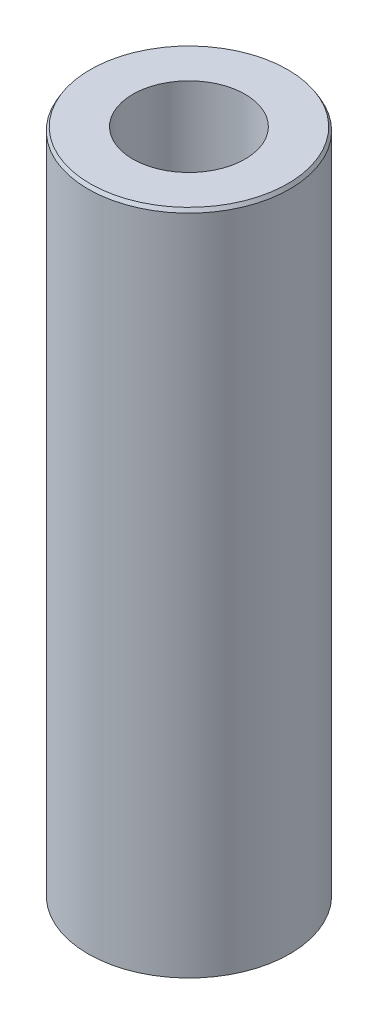
ISO-10303-21;
HEADER;
FILE_DESCRIPTION(('STEP AP214'),'2;1');
FILE_NAME('part.step','',(''),(''),'','','');
FILE_SCHEMA(('AUTOMOTIVE_DESIGN { 1 0 10303 214 1 1 1 1 }'));
ENDSEC;
DATA;
#1=APPLICATION_CONTEXT('core data for automotive mechanical design processes');
#2=APPLICATION_PROTOCOL_DEFINITION('international standard','automotive_design',2000,#1);
#3=PRODUCT_CONTEXT('',#1,'mechanical');
#4=PRODUCT('Part','Part','',(#3));
#5=PRODUCT_RELATED_PRODUCT_CATEGORY('part','',(#4));
#6=PRODUCT_DEFINITION_FORMATION('','',#4);
#7=PRODUCT_DEFINITION_CONTEXT('part definition',#1,'design');
#8=PRODUCT_DEFINITION('design','',#6,#7);
#9=PRODUCT_DEFINITION_SHAPE('','',#8);
#10=(LENGTH_UNIT() NAMED_UNIT(*) SI_UNIT(.MILLI.,.METRE.));
#11=(NAMED_UNIT(*) PLANE_ANGLE_UNIT() SI_UNIT($,.RADIAN.));
#12=(NAMED_UNIT(*) SI_UNIT($,.STERADIAN.) SOLID_ANGLE_UNIT());
#13=UNCERTAINTY_MEASURE_WITH_UNIT(LENGTH_MEASURE(1.E-05),#10,'distance_accuracy_value','');
#14=(GEOMETRIC_REPRESENTATION_CONTEXT(3) GLOBAL_UNCERTAINTY_ASSIGNED_CONTEXT((#13)) GLOBAL_UNIT_ASSIGNED_CONTEXT((#10,
#11,#12)) REPRESENTATION_CONTEXT('',''));
#15=CARTESIAN_POINT('',(0.,0.,0.));
#16=DIRECTION('',(0.,0.,1.));
#17=DIRECTION('',(1.,0.,0.));
#18=AXIS2_PLACEMENT_3D('',#15,#16,#17);
#19=CARTESIAN_POINT('',(0.,281.374735321229,0.));
#20=DIRECTION('',(0.,-1.,0.));
#21=DIRECTION('',(0.,0.,-1.));
#22=AXIS2_PLACEMENT_3D('',#19,#20,#21);
#23=CYLINDRICAL_SURFACE('',#22,42.5);
#24=CARTESIAN_POINT('',(0.,279.862351572735,0.));
#25=DIRECTION('',(0.,1.,0.));
#26=DIRECTION('',(0.,0.,1.));
#27=AXIS2_PLACEMENT_3D('',#24,#25,#26);
#28=CIRCLE('',#27,42.5);
#29=CARTESIAN_POINT('',(0.,279.862351572735,42.5));
#30=VERTEX_POINT('',#29);
#31=EDGE_CURVE('E50',#30,#30,#28,.F.);
#32=ORIENTED_EDGE('',*,*,#31,.T.);
#33=EDGE_LOOP('',(#32));
#34=FACE_BOUND('',#33,.T.);
#35=CARTESIAN_POINT('',(0.,0.873175164310791,0.));
#36=DIRECTION('',(0.,1.,0.));
#37=DIRECTION('',(0.,0.,1.));
#38=AXIS2_PLACEMENT_3D('',#35,#36,#37);
#39=CIRCLE('',#38,42.5);
#40=CARTESIAN_POINT('',(0.,0.873175164310791,42.5));
#41=VERTEX_POINT('',#40);
#42=EDGE_CURVE('E51',#41,#41,#39,.T.);
#43=ORIENTED_EDGE('',*,*,#42,.T.);
#44=EDGE_LOOP('',(#43));
#45=FACE_BOUND('',#44,.T.);
#46=ADVANCED_FACE('F39',(#34,#45),#23,.T.);
#47=CARTESIAN_POINT('',(0.,281.374735321229,0.));
#48=DIRECTION('',(0.,1.,0.));
#49=DIRECTION('',(0.,0.,1.));
#50=AXIS2_PLACEMENT_3D('',#47,#48,#49);
#51=PLANE('',#50);
#52=CARTESIAN_POINT('',(0.,281.374735321229,0.));
#53=DIRECTION('',(0.,1.,0.));
#54=DIRECTION('',(0.,0.,1.));
#55=AXIS2_PLACEMENT_3D('',#52,#53,#54);
#56=CIRCLE('',#55,41.6268248356892);
#57=CARTESIAN_POINT('',(0.,281.374735321229,41.6268248356892));
#58=VERTEX_POINT('',#57);
#59=EDGE_CURVE('E54',#58,#58,#56,.T.);
#60=ORIENTED_EDGE('',*,*,#59,.T.);
#61=EDGE_LOOP('',(#60));
#62=FACE_BOUND('',#61,.T.);
#63=CARTESIAN_POINT('',(0.,281.374735321229,0.));
#64=DIRECTION('',(0.,1.,0.));
#65=DIRECTION('',(0.,0.,1.));
#66=AXIS2_PLACEMENT_3D('',#63,#64,#65);
#67=CIRCLE('',#66,23.6644801768777);
#68=CARTESIAN_POINT('',(0.,281.374735321229,23.6644801768777));
#69=VERTEX_POINT('',#68);
#70=EDGE_CURVE('E58',#69,#69,#67,.T.);
#71=ORIENTED_EDGE('',*,*,#70,.F.);
#72=EDGE_LOOP('',(#71));
#73=FACE_BOUND('',#72,.T.);
#74=ADVANCED_FACE('F69',(#62,#73),#51,.T.);
#75=CARTESIAN_POINT('',(0.,0.,0.));
#76=DIRECTION('',(0.,1.,0.));
#77=DIRECTION('',(0.,0.,1.));
#78=AXIS2_PLACEMENT_3D('',#75,#76,#77);
#79=PLANE('',#78);
#80=CARTESIAN_POINT('',(0.,0.,0.));
#81=DIRECTION('',(0.,1.,0.));
#82=DIRECTION('',(0.,0.,1.));
#83=AXIS2_PLACEMENT_3D('',#80,#81,#82);
#84=CIRCLE('',#83,40.9876162515064);
#85=CARTESIAN_POINT('',(0.,0.,40.9876162515064));
#86=VERTEX_POINT('',#85);
#87=EDGE_CURVE('E10',#86,#86,#84,.F.);
#88=ORIENTED_EDGE('',*,*,#87,.T.);
#89=EDGE_LOOP('',(#88));
#90=FACE_BOUND('',#89,.T.);
#91=CARTESIAN_POINT('',(0.,0.,0.));
#92=DIRECTION('',(0.,1.,0.));
#93=DIRECTION('',(0.,0.,1.));
#94=AXIS2_PLACEMENT_3D('',#91,#92,#93);
#95=CIRCLE('',#94,23.6644801768777);
#96=CARTESIAN_POINT('',(0.,0.,23.6644801768777));
#97=VERTEX_POINT('',#96);
#98=EDGE_CURVE('E63',#97,#97,#95,.T.);
#99=ORIENTED_EDGE('',*,*,#98,.T.);
#100=EDGE_LOOP('',(#99));
#101=FACE_BOUND('',#100,.T.);
#102=ADVANCED_FACE('F75',(#90,#101),#79,.F.);
#103=CARTESIAN_POINT('',(0.,281.374735321229,0.));
#104=DIRECTION('',(0.,-1.,0.));
#105=DIRECTION('',(0.,0.,-1.));
#106=AXIS2_PLACEMENT_3D('',#103,#104,#105);
#107=CYLINDRICAL_SURFACE('',#106,23.6644801768777);
#108=ORIENTED_EDGE('',*,*,#70,.T.);
#109=EDGE_LOOP('',(#108));
#110=FACE_BOUND('',#109,.T.);
#111=ORIENTED_EDGE('',*,*,#98,.F.);
#112=EDGE_LOOP('',(#111));
#113=FACE_BOUND('',#112,.T.);
#114=ADVANCED_FACE('F70',(#110,#113),#107,.F.);
#115=CARTESIAN_POINT('',(0.,281.374735321229,0.));
#116=DIRECTION('',(0.,-1.,0.));
#117=DIRECTION('',(0.,0.,-1.));
#118=AXIS2_PLACEMENT_3D('',#115,#116,#117);
#119=CONICAL_SURFACE('',#118,41.6268248356892,0.523598775598295);
#120=ORIENTED_EDGE('',*,*,#31,.F.);
#121=EDGE_LOOP('',(#120));
#122=FACE_BOUND('',#121,.T.);
#123=ORIENTED_EDGE('',*,*,#59,.F.);
#124=EDGE_LOOP('',(#123));
#125=FACE_BOUND('',#124,.T.);
#126=ADVANCED_FACE('F81',(#122,#125),#119,.T.);
#127=CARTESIAN_POINT('',(0.,0.873175164310791,0.));
#128=DIRECTION('',(0.,1.,0.));
#129=DIRECTION('',(0.,0.,1.));
#130=AXIS2_PLACEMENT_3D('',#127,#128,#129);
#131=CONICAL_SURFACE('',#130,42.5,1.0471975511966);
#132=ORIENTED_EDGE('',*,*,#87,.F.);
#133=EDGE_LOOP('',(#132));
#134=FACE_BOUND('',#133,.T.);
#135=ORIENTED_EDGE('',*,*,#42,.F.);
#136=EDGE_LOOP('',(#135));
#137=FACE_BOUND('',#136,.T.);
#138=ADVANCED_FACE('F45',(#134,#137),#131,.T.);
#139=CLOSED_SHELL('',(#46,#74,#102,#114,#126,#138));
#140=MANIFOLD_SOLID_BREP('B2',#139);
#141=ADVANCED_BREP_SHAPE_REPRESENTATION('',(#18,#140),#14);
#142=SHAPE_DEFINITION_REPRESENTATION(#9,#141);
ENDSEC;
END-ISO-10303-21;
